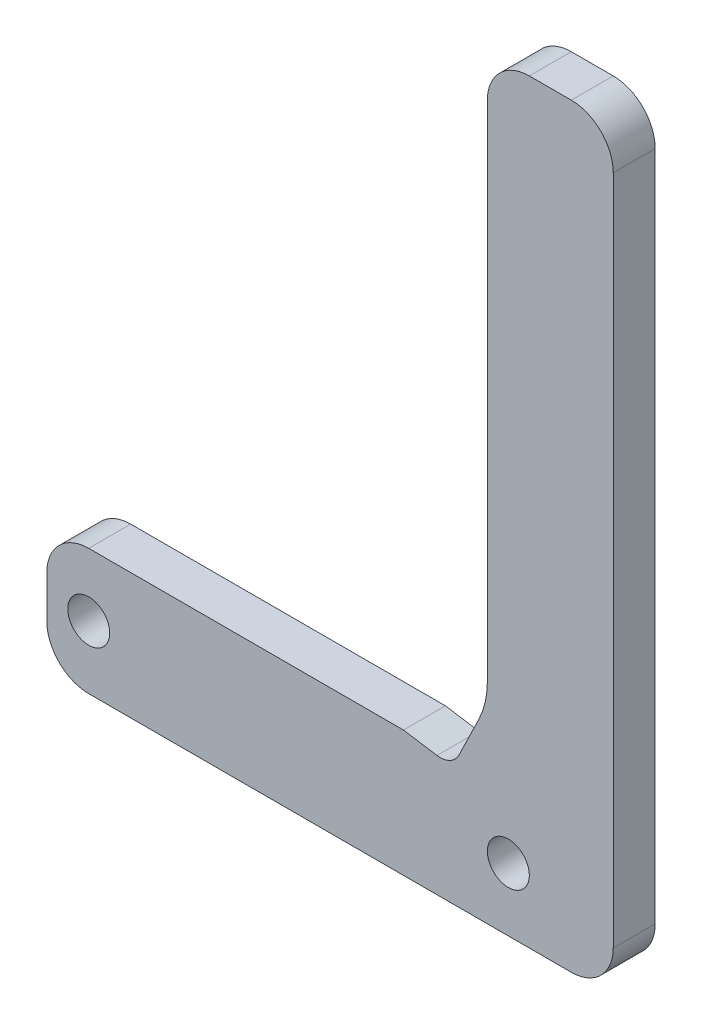
ISO-10303-21;
HEADER;
FILE_DESCRIPTION(('STEP AP214'),'2;1');
FILE_NAME('part.step','',(''),(''),'','','');
FILE_SCHEMA(('AUTOMOTIVE_DESIGN { 1 0 10303 214 1 1 1 1 }'));
ENDSEC;
DATA;
#1=APPLICATION_CONTEXT('core data for automotive mechanical design processes');
#2=APPLICATION_PROTOCOL_DEFINITION('international standard','automotive_design',2000,#1);
#3=PRODUCT_CONTEXT('',#1,'mechanical');
#4=PRODUCT('Part','Part','',(#3));
#5=PRODUCT_RELATED_PRODUCT_CATEGORY('part','',(#4));
#6=PRODUCT_DEFINITION_FORMATION('','',#4);
#7=PRODUCT_DEFINITION_CONTEXT('part definition',#1,'design');
#8=PRODUCT_DEFINITION('design','',#6,#7);
#9=PRODUCT_DEFINITION_SHAPE('','',#8);
#10=(LENGTH_UNIT() NAMED_UNIT(*) SI_UNIT(.MILLI.,.METRE.));
#11=(NAMED_UNIT(*) PLANE_ANGLE_UNIT() SI_UNIT($,.RADIAN.));
#12=(NAMED_UNIT(*) SI_UNIT($,.STERADIAN.) SOLID_ANGLE_UNIT());
#13=UNCERTAINTY_MEASURE_WITH_UNIT(LENGTH_MEASURE(1.E-05),#10,'distance_accuracy_value','');
#14=(GEOMETRIC_REPRESENTATION_CONTEXT(3) GLOBAL_UNCERTAINTY_ASSIGNED_CONTEXT((#13)) GLOBAL_UNIT_ASSIGNED_CONTEXT((#10,
#11,#12)) REPRESENTATION_CONTEXT('',''));
#15=CARTESIAN_POINT('',(0.,0.,0.));
#16=DIRECTION('',(0.,0.,1.));
#17=DIRECTION('',(1.,0.,0.));
#18=AXIS2_PLACEMENT_3D('',#15,#16,#17);
#19=CARTESIAN_POINT('',(0.,0.,6.35));
#20=DIRECTION('',(0.,0.,1.));
#21=DIRECTION('',(1.,0.,0.));
#22=AXIS2_PLACEMENT_3D('',#19,#20,#21);
#23=PLANE('',#22);
#24=CARTESIAN_POINT('',(69.85,9.525,6.35));
#25=DIRECTION('',(0.,0.,1.));
#26=DIRECTION('',(1.,0.,0.));
#27=AXIS2_PLACEMENT_3D('',#24,#25,#26);
#28=CIRCLE('',#27,3.175);
#29=CARTESIAN_POINT('',(73.025,9.525,6.35));
#30=VERTEX_POINT('',#29);
#31=EDGE_CURVE('E179',#30,#30,#28,.T.);
#32=ORIENTED_EDGE('',*,*,#31,.F.);
#33=EDGE_LOOP('',(#32));
#34=FACE_BOUND('',#33,.T.);
#35=CARTESIAN_POINT('',(6.35,9.525,6.35));
#36=DIRECTION('',(0.,0.,1.));
#37=DIRECTION('',(1.,0.,0.));
#38=AXIS2_PLACEMENT_3D('',#35,#36,#37);
#39=CIRCLE('',#38,3.175);
#40=CARTESIAN_POINT('',(9.525,9.525,6.35));
#41=VERTEX_POINT('',#40);
#42=EDGE_CURVE('E173',#41,#41,#39,.T.);
#43=ORIENTED_EDGE('',*,*,#42,.F.);
#44=EDGE_LOOP('',(#43));
#45=FACE_BOUND('',#44,.T.);
#46=CARTESIAN_POINT('',(59.5451465948687,21.3931882071597,6.35));
#47=DIRECTION('',(0.,0.,1.));
#48=DIRECTION('',(1.,0.,0.));
#49=AXIS2_PLACEMENT_3D('',#46,#47,#48);
#50=CIRCLE('',#49,3.17500000000001);
#51=CARTESIAN_POINT('',(59.055,18.25625,6.35));
#52=VERTEX_POINT('',#51);
#53=CARTESIAN_POINT('',(62.4031605487387,20.0102994771873,6.35));
#54=VERTEX_POINT('',#53);
#55=EDGE_CURVE('E163',#52,#54,#50,.T.);
#56=ORIENTED_EDGE('',*,*,#55,.F.);
#57=DIRECTION('',(-0.988012033751101,0.154376880273609,0.));
#58=VECTOR('',#57,1.);
#59=CARTESIAN_POINT('',(4.19196854146806,26.8285986653956,6.35));
#60=LINE('',#59,#58);
#61=CARTESIAN_POINT('',(53.975,19.05,6.35));
#62=VERTEX_POINT('',#61);
#63=EDGE_CURVE('E146',#52,#62,#60,.T.);
#64=ORIENTED_EDGE('',*,*,#63,.T.);
#65=DIRECTION('',(-1.,0.,0.));
#66=VECTOR('',#65,1.);
#67=CARTESIAN_POINT('',(66.675,19.05,6.35));
#68=LINE('',#67,#66);
#69=CARTESIAN_POINT('',(6.35,19.05,6.35));
#70=VERTEX_POINT('',#69);
#71=EDGE_CURVE('E184',#62,#70,#68,.T.);
#72=ORIENTED_EDGE('',*,*,#71,.T.);
#73=CARTESIAN_POINT('',(6.35,12.7,6.35));
#74=DIRECTION('',(0.,0.,1.));
#75=DIRECTION('',(1.,0.,0.));
#76=AXIS2_PLACEMENT_3D('',#73,#74,#75);
#77=CIRCLE('',#76,6.35);
#78=CARTESIAN_POINT('',(0.,12.7,6.35));
#79=VERTEX_POINT('',#78);
#80=EDGE_CURVE('E234',#70,#79,#77,.T.);
#81=ORIENTED_EDGE('',*,*,#80,.T.);
#82=DIRECTION('',(0.,-1.,0.));
#83=VECTOR('',#82,1.);
#84=CARTESIAN_POINT('',(0.,19.05,6.35));
#85=LINE('',#84,#83);
#86=CARTESIAN_POINT('',(0.,6.35,6.35));
#87=VERTEX_POINT('',#86);
#88=EDGE_CURVE('E186',#79,#87,#85,.T.);
#89=ORIENTED_EDGE('',*,*,#88,.T.);
#90=CARTESIAN_POINT('',(6.35,6.35,6.35));
#91=DIRECTION('',(0.,0.,1.));
#92=DIRECTION('',(1.,0.,0.));
#93=AXIS2_PLACEMENT_3D('',#90,#91,#92);
#94=CIRCLE('',#93,6.35);
#95=CARTESIAN_POINT('',(6.35,0.,6.35));
#96=VERTEX_POINT('',#95);
#97=EDGE_CURVE('E236',#87,#96,#94,.T.);
#98=ORIENTED_EDGE('',*,*,#97,.T.);
#99=DIRECTION('',(1.,0.,0.));
#100=VECTOR('',#99,1.);
#101=CARTESIAN_POINT('',(0.,0.,6.35));
#102=LINE('',#101,#100);
#103=CARTESIAN_POINT('',(79.375,0.,6.35));
#104=VERTEX_POINT('',#103);
#105=EDGE_CURVE('E190',#96,#104,#102,.T.);
#106=ORIENTED_EDGE('',*,*,#105,.T.);
#107=CARTESIAN_POINT('',(79.375,6.35,6.35));
#108=DIRECTION('',(0.,0.,1.));
#109=DIRECTION('',(1.,0.,0.));
#110=AXIS2_PLACEMENT_3D('',#107,#108,#109);
#111=CIRCLE('',#110,6.35);
#112=CARTESIAN_POINT('',(85.725,6.35,6.35));
#113=VERTEX_POINT('',#112);
#114=EDGE_CURVE('E238',#104,#113,#111,.T.);
#115=ORIENTED_EDGE('',*,*,#114,.T.);
#116=DIRECTION('',(0.,1.,0.));
#117=VECTOR('',#116,1.);
#118=CARTESIAN_POINT('',(85.725,0.,6.35));
#119=LINE('',#118,#117);
#120=CARTESIAN_POINT('',(85.725,107.95,6.35));
#121=VERTEX_POINT('',#120);
#122=EDGE_CURVE('E193',#113,#121,#119,.T.);
#123=ORIENTED_EDGE('',*,*,#122,.T.);
#124=CARTESIAN_POINT('',(79.375,107.95,6.35));
#125=DIRECTION('',(0.,0.,1.));
#126=DIRECTION('',(1.,0.,0.));
#127=AXIS2_PLACEMENT_3D('',#124,#125,#126);
#128=CIRCLE('',#127,6.35);
#129=CARTESIAN_POINT('',(79.375,114.3,6.35));
#130=VERTEX_POINT('',#129);
#131=EDGE_CURVE('E240',#121,#130,#128,.T.);
#132=ORIENTED_EDGE('',*,*,#131,.T.);
#133=DIRECTION('',(-1.,0.,0.));
#134=VECTOR('',#133,1.);
#135=CARTESIAN_POINT('',(85.725,114.3,6.35));
#136=LINE('',#135,#134);
#137=CARTESIAN_POINT('',(73.025,114.3,6.35));
#138=VERTEX_POINT('',#137);
#139=EDGE_CURVE('E196',#130,#138,#136,.T.);
#140=ORIENTED_EDGE('',*,*,#139,.T.);
#141=CARTESIAN_POINT('',(73.025,107.95,6.35));
#142=DIRECTION('',(0.,0.,1.));
#143=DIRECTION('',(1.,0.,0.));
#144=AXIS2_PLACEMENT_3D('',#141,#142,#143);
#145=CIRCLE('',#144,6.35);
#146=CARTESIAN_POINT('',(66.675,107.95,6.35));
#147=VERTEX_POINT('',#146);
#148=EDGE_CURVE('E242',#138,#147,#145,.T.);
#149=ORIENTED_EDGE('',*,*,#148,.T.);
#150=DIRECTION('',(0.,-1.,0.));
#151=VECTOR('',#150,1.);
#152=CARTESIAN_POINT('',(66.675,114.3,6.35));
#153=LINE('',#152,#151);
#154=CARTESIAN_POINT('',(66.675,31.75,6.35));
#155=VERTEX_POINT('',#154);
#156=EDGE_CURVE('E199',#147,#155,#153,.T.);
#157=ORIENTED_EDGE('',*,*,#156,.T.);
#158=CARTESIAN_POINT('',(53.975,31.75,6.35));
#159=DIRECTION('',(0.,0.,1.));
#160=DIRECTION('',(1.,0.,0.));
#161=AXIS2_PLACEMENT_3D('',#158,#159,#160);
#162=CIRCLE('',#161,12.7);
#163=CARTESIAN_POINT('',(65.4070558154798,26.2184450801104,6.35));
#164=VERTEX_POINT('',#163);
#165=EDGE_CURVE('E11',#155,#164,#162,.F.);
#166=ORIENTED_EDGE('',*,*,#165,.T.);
#167=DIRECTION('',(-0.435555505503119,-0.900161875234628,0.));
#168=VECTOR('',#167,1.);
#169=CARTESIAN_POINT('',(42.719297094111,-20.6703100325301,6.35));
#170=LINE('',#169,#168);
#171=EDGE_CURVE('E47',#164,#54,#170,.T.);
#172=ORIENTED_EDGE('',*,*,#171,.T.);
#173=EDGE_LOOP('',(#56,#64,#72,#81,#89,#98,#106,#115,#123,#132,#140,#149,#157,#166,#172));
#174=FACE_BOUND('',#173,.T.);
#175=ADVANCED_FACE('F32',(#34,#45,#174),#23,.T.);
#176=CARTESIAN_POINT('',(0.,0.,0.));
#177=DIRECTION('',(0.,0.,1.));
#178=DIRECTION('',(1.,0.,0.));
#179=AXIS2_PLACEMENT_3D('',#176,#177,#178);
#180=PLANE('',#179);
#181=CARTESIAN_POINT('',(6.35,9.525,0.));
#182=DIRECTION('',(0.,0.,1.));
#183=DIRECTION('',(1.,0.,0.));
#184=AXIS2_PLACEMENT_3D('',#181,#182,#183);
#185=CIRCLE('',#184,3.175);
#186=CARTESIAN_POINT('',(9.525,9.525,0.));
#187=VERTEX_POINT('',#186);
#188=EDGE_CURVE('E171',#187,#187,#185,.T.);
#189=ORIENTED_EDGE('',*,*,#188,.T.);
#190=EDGE_LOOP('',(#189));
#191=FACE_BOUND('',#190,.T.);
#192=CARTESIAN_POINT('',(69.85,9.525,0.));
#193=DIRECTION('',(0.,0.,1.));
#194=DIRECTION('',(1.,0.,0.));
#195=AXIS2_PLACEMENT_3D('',#192,#193,#194);
#196=CIRCLE('',#195,3.175);
#197=CARTESIAN_POINT('',(73.025,9.525,0.));
#198=VERTEX_POINT('',#197);
#199=EDGE_CURVE('E176',#198,#198,#196,.T.);
#200=ORIENTED_EDGE('',*,*,#199,.T.);
#201=EDGE_LOOP('',(#200));
#202=FACE_BOUND('',#201,.T.);
#203=DIRECTION('',(-0.988012033751101,0.154376880273609,0.));
#204=VECTOR('',#203,1.);
#205=CARTESIAN_POINT('',(4.19196854146806,26.8285986653956,0.));
#206=LINE('',#205,#204);
#207=CARTESIAN_POINT('',(59.055,18.25625,0.));
#208=VERTEX_POINT('',#207);
#209=CARTESIAN_POINT('',(53.975,19.05,0.));
#210=VERTEX_POINT('',#209);
#211=EDGE_CURVE('E143',#208,#210,#206,.T.);
#212=ORIENTED_EDGE('',*,*,#211,.F.);
#213=CARTESIAN_POINT('',(59.5451465948687,21.3931882071597,0.));
#214=DIRECTION('',(0.,0.,1.));
#215=DIRECTION('',(1.,0.,0.));
#216=AXIS2_PLACEMENT_3D('',#213,#214,#215);
#217=CIRCLE('',#216,3.17500000000001);
#218=CARTESIAN_POINT('',(62.4031605487387,20.0102994771873,0.));
#219=VERTEX_POINT('',#218);
#220=EDGE_CURVE('E155',#208,#219,#217,.T.);
#221=ORIENTED_EDGE('',*,*,#220,.T.);
#222=DIRECTION('',(-0.435555505503119,-0.900161875234628,0.));
#223=VECTOR('',#222,1.);
#224=CARTESIAN_POINT('',(42.719297094111,-20.6703100325301,0.));
#225=LINE('',#224,#223);
#226=CARTESIAN_POINT('',(65.4070558154798,26.2184450801104,0.));
#227=VERTEX_POINT('',#226);
#228=EDGE_CURVE('E151',#227,#219,#225,.T.);
#229=ORIENTED_EDGE('',*,*,#228,.F.);
#230=CARTESIAN_POINT('',(53.975,31.75,0.));
#231=DIRECTION('',(0.,0.,1.));
#232=DIRECTION('',(1.,0.,0.));
#233=AXIS2_PLACEMENT_3D('',#230,#231,#232);
#234=CIRCLE('',#233,12.7);
#235=CARTESIAN_POINT('',(66.675,31.75,0.));
#236=VERTEX_POINT('',#235);
#237=EDGE_CURVE('E40',#227,#236,#234,.T.);
#238=ORIENTED_EDGE('',*,*,#237,.T.);
#239=DIRECTION('',(0.,-1.,0.));
#240=VECTOR('',#239,1.);
#241=CARTESIAN_POINT('',(66.675,114.3,0.));
#242=LINE('',#241,#240);
#243=CARTESIAN_POINT('',(66.675,107.95,0.));
#244=VERTEX_POINT('',#243);
#245=EDGE_CURVE('E187',#244,#236,#242,.T.);
#246=ORIENTED_EDGE('',*,*,#245,.F.);
#247=CARTESIAN_POINT('',(73.025,107.95,0.));
#248=DIRECTION('',(0.,0.,1.));
#249=DIRECTION('',(1.,0.,0.));
#250=AXIS2_PLACEMENT_3D('',#247,#248,#249);
#251=CIRCLE('',#250,6.35);
#252=CARTESIAN_POINT('',(73.025,114.3,0.));
#253=VERTEX_POINT('',#252);
#254=EDGE_CURVE('E227',#244,#253,#251,.F.);
#255=ORIENTED_EDGE('',*,*,#254,.T.);
#256=DIRECTION('',(-1.,0.,0.));
#257=VECTOR('',#256,1.);
#258=CARTESIAN_POINT('',(85.725,114.3,0.));
#259=LINE('',#258,#257);
#260=CARTESIAN_POINT('',(79.375,114.3,0.));
#261=VERTEX_POINT('',#260);
#262=EDGE_CURVE('E213',#261,#253,#259,.T.);
#263=ORIENTED_EDGE('',*,*,#262,.F.);
#264=CARTESIAN_POINT('',(79.375,107.95,0.));
#265=DIRECTION('',(0.,0.,1.));
#266=DIRECTION('',(1.,0.,0.));
#267=AXIS2_PLACEMENT_3D('',#264,#265,#266);
#268=CIRCLE('',#267,6.35);
#269=CARTESIAN_POINT('',(85.725,107.95,0.));
#270=VERTEX_POINT('',#269);
#271=EDGE_CURVE('E225',#261,#270,#268,.F.);
#272=ORIENTED_EDGE('',*,*,#271,.T.);
#273=DIRECTION('',(0.,1.,0.));
#274=VECTOR('',#273,1.);
#275=CARTESIAN_POINT('',(85.725,0.,0.));
#276=LINE('',#275,#274);
#277=CARTESIAN_POINT('',(85.725,6.35,0.));
#278=VERTEX_POINT('',#277);
#279=EDGE_CURVE('E210',#278,#270,#276,.T.);
#280=ORIENTED_EDGE('',*,*,#279,.F.);
#281=CARTESIAN_POINT('',(79.375,6.35,0.));
#282=DIRECTION('',(0.,0.,1.));
#283=DIRECTION('',(1.,0.,0.));
#284=AXIS2_PLACEMENT_3D('',#281,#282,#283);
#285=CIRCLE('',#284,6.35);
#286=CARTESIAN_POINT('',(79.375,0.,0.));
#287=VERTEX_POINT('',#286);
#288=EDGE_CURVE('E223',#278,#287,#285,.F.);
#289=ORIENTED_EDGE('',*,*,#288,.T.);
#290=DIRECTION('',(1.,0.,0.));
#291=VECTOR('',#290,1.);
#292=CARTESIAN_POINT('',(0.,0.,0.));
#293=LINE('',#292,#291);
#294=CARTESIAN_POINT('',(6.35,0.,0.));
#295=VERTEX_POINT('',#294);
#296=EDGE_CURVE('E207',#295,#287,#293,.T.);
#297=ORIENTED_EDGE('',*,*,#296,.F.);
#298=CARTESIAN_POINT('',(6.35,6.35,0.));
#299=DIRECTION('',(0.,0.,1.));
#300=DIRECTION('',(1.,0.,0.));
#301=AXIS2_PLACEMENT_3D('',#298,#299,#300);
#302=CIRCLE('',#301,6.35);
#303=CARTESIAN_POINT('',(0.,6.35,0.));
#304=VERTEX_POINT('',#303);
#305=EDGE_CURVE('E221',#295,#304,#302,.F.);
#306=ORIENTED_EDGE('',*,*,#305,.T.);
#307=DIRECTION('',(0.,-1.,0.));
#308=VECTOR('',#307,1.);
#309=CARTESIAN_POINT('',(0.,19.05,0.));
#310=LINE('',#309,#308);
#311=CARTESIAN_POINT('',(0.,12.7,0.));
#312=VERTEX_POINT('',#311);
#313=EDGE_CURVE('E204',#312,#304,#310,.T.);
#314=ORIENTED_EDGE('',*,*,#313,.F.);
#315=CARTESIAN_POINT('',(6.35,12.7,0.));
#316=DIRECTION('',(0.,0.,1.));
#317=DIRECTION('',(1.,0.,0.));
#318=AXIS2_PLACEMENT_3D('',#315,#316,#317);
#319=CIRCLE('',#318,6.35);
#320=CARTESIAN_POINT('',(6.35,19.05,0.));
#321=VERTEX_POINT('',#320);
#322=EDGE_CURVE('E219',#312,#321,#319,.F.);
#323=ORIENTED_EDGE('',*,*,#322,.T.);
#324=DIRECTION('',(-1.,0.,0.));
#325=VECTOR('',#324,1.);
#326=CARTESIAN_POINT('',(66.675,19.05,0.));
#327=LINE('',#326,#325);
#328=EDGE_CURVE('E161',#210,#321,#327,.T.);
#329=ORIENTED_EDGE('',*,*,#328,.F.);
#330=EDGE_LOOP('',(#212,#221,#229,#238,#246,#255,#263,#272,#280,#289,#297,#306,#314,#323,#329));
#331=FACE_BOUND('',#330,.T.);
#332=ADVANCED_FACE('F159',(#191,#202,#331),#180,.F.);
#333=CARTESIAN_POINT('',(53.975,31.75,6.35));
#334=DIRECTION('',(0.,0.,1.));
#335=DIRECTION('',(1.,0.,0.));
#336=AXIS2_PLACEMENT_3D('',#333,#334,#335);
#337=CYLINDRICAL_SURFACE('',#336,12.7);
#338=DIRECTION('',(0.,0.,1.));
#339=VECTOR('',#338,1.);
#340=CARTESIAN_POINT('',(65.4070558154798,26.2184450801104,0.));
#341=LINE('',#340,#339);
#342=EDGE_CURVE('E169',#227,#164,#341,.T.);
#343=ORIENTED_EDGE('',*,*,#342,.T.);
#344=ORIENTED_EDGE('',*,*,#165,.F.);
#345=DIRECTION('',(0.,0.,-1.));
#346=VECTOR('',#345,1.);
#347=CARTESIAN_POINT('',(66.675,31.75,6.35));
#348=LINE('',#347,#346);
#349=EDGE_CURVE('E264',#236,#155,#348,.F.);
#350=ORIENTED_EDGE('',*,*,#349,.F.);
#351=ORIENTED_EDGE('',*,*,#237,.F.);
#352=EDGE_LOOP('',(#343,#344,#350,#351));
#353=FACE_BOUND('',#352,.T.);
#354=ADVANCED_FACE('F34',(#353),#337,.F.);
#355=CARTESIAN_POINT('',(66.675,19.05,6.35));
#356=DIRECTION('',(0.,-1.,0.));
#357=DIRECTION('',(1.,0.,0.));
#358=AXIS2_PLACEMENT_3D('',#355,#356,#357);
#359=PLANE('',#358);
#360=ORIENTED_EDGE('',*,*,#71,.F.);
#361=DIRECTION('',(0.,0.,-1.));
#362=VECTOR('',#361,1.);
#363=CARTESIAN_POINT('',(53.975,19.05,0.));
#364=LINE('',#363,#362);
#365=EDGE_CURVE('E262',#62,#210,#364,.T.);
#366=ORIENTED_EDGE('',*,*,#365,.T.);
#367=ORIENTED_EDGE('',*,*,#328,.T.);
#368=DIRECTION('',(0.,0.,-1.));
#369=VECTOR('',#368,1.);
#370=CARTESIAN_POINT('',(6.35,19.05,6.35));
#371=LINE('',#370,#369);
#372=EDGE_CURVE('E259',#321,#70,#371,.F.);
#373=ORIENTED_EDGE('',*,*,#372,.T.);
#374=EDGE_LOOP('',(#360,#366,#367,#373));
#375=FACE_BOUND('',#374,.T.);
#376=ADVANCED_FACE('F277',(#375),#359,.F.);
#377=CARTESIAN_POINT('',(0.,19.05,6.35));
#378=DIRECTION('',(1.,0.,0.));
#379=DIRECTION('',(0.,0.,-1.));
#380=AXIS2_PLACEMENT_3D('',#377,#378,#379);
#381=PLANE('',#380);
#382=ORIENTED_EDGE('',*,*,#313,.T.);
#383=DIRECTION('',(0.,0.,-1.));
#384=VECTOR('',#383,1.);
#385=CARTESIAN_POINT('',(0.,6.35,6.35));
#386=LINE('',#385,#384);
#387=EDGE_CURVE('E257',#304,#87,#386,.F.);
#388=ORIENTED_EDGE('',*,*,#387,.T.);
#389=ORIENTED_EDGE('',*,*,#88,.F.);
#390=DIRECTION('',(0.,0.,-1.));
#391=VECTOR('',#390,1.);
#392=CARTESIAN_POINT('',(0.,12.7,6.35));
#393=LINE('',#392,#391);
#394=EDGE_CURVE('E254',#79,#312,#393,.T.);
#395=ORIENTED_EDGE('',*,*,#394,.T.);
#396=EDGE_LOOP('',(#382,#388,#389,#395));
#397=FACE_BOUND('',#396,.T.);
#398=ADVANCED_FACE('F286',(#397),#381,.F.);
#399=CARTESIAN_POINT('',(0.,0.,6.35));
#400=DIRECTION('',(0.,1.,0.));
#401=DIRECTION('',(0.,0.,1.));
#402=AXIS2_PLACEMENT_3D('',#399,#400,#401);
#403=PLANE('',#402);
#404=ORIENTED_EDGE('',*,*,#296,.T.);
#405=DIRECTION('',(0.,0.,-1.));
#406=VECTOR('',#405,1.);
#407=CARTESIAN_POINT('',(79.375,0.,6.35));
#408=LINE('',#407,#406);
#409=EDGE_CURVE('E252',#287,#104,#408,.F.);
#410=ORIENTED_EDGE('',*,*,#409,.T.);
#411=ORIENTED_EDGE('',*,*,#105,.F.);
#412=DIRECTION('',(0.,0.,-1.));
#413=VECTOR('',#412,1.);
#414=CARTESIAN_POINT('',(6.35,0.,6.35));
#415=LINE('',#414,#413);
#416=EDGE_CURVE('E249',#96,#295,#415,.T.);
#417=ORIENTED_EDGE('',*,*,#416,.T.);
#418=EDGE_LOOP('',(#404,#410,#411,#417));
#419=FACE_BOUND('',#418,.T.);
#420=ADVANCED_FACE('F295',(#419),#403,.F.);
#421=CARTESIAN_POINT('',(85.725,0.,6.35));
#422=DIRECTION('',(-1.,0.,0.));
#423=DIRECTION('',(0.,0.,1.));
#424=AXIS2_PLACEMENT_3D('',#421,#422,#423);
#425=PLANE('',#424);
#426=ORIENTED_EDGE('',*,*,#279,.T.);
#427=DIRECTION('',(0.,0.,-1.));
#428=VECTOR('',#427,1.);
#429=CARTESIAN_POINT('',(85.725,107.95,6.35));
#430=LINE('',#429,#428);
#431=EDGE_CURVE('E247',#270,#121,#430,.F.);
#432=ORIENTED_EDGE('',*,*,#431,.T.);
#433=ORIENTED_EDGE('',*,*,#122,.F.);
#434=DIRECTION('',(0.,0.,-1.));
#435=VECTOR('',#434,1.);
#436=CARTESIAN_POINT('',(85.725,6.35,6.35));
#437=LINE('',#436,#435);
#438=EDGE_CURVE('E244',#113,#278,#437,.T.);
#439=ORIENTED_EDGE('',*,*,#438,.T.);
#440=EDGE_LOOP('',(#426,#432,#433,#439));
#441=FACE_BOUND('',#440,.T.);
#442=ADVANCED_FACE('F304',(#441),#425,.F.);
#443=CARTESIAN_POINT('',(85.725,114.3,6.35));
#444=DIRECTION('',(0.,-1.,0.));
#445=DIRECTION('',(0.,0.,-1.));
#446=AXIS2_PLACEMENT_3D('',#443,#444,#445);
#447=PLANE('',#446);
#448=ORIENTED_EDGE('',*,*,#262,.T.);
#449=DIRECTION('',(0.,0.,-1.));
#450=VECTOR('',#449,1.);
#451=CARTESIAN_POINT('',(73.025,114.3,6.35));
#452=LINE('',#451,#450);
#453=EDGE_CURVE('E232',#253,#138,#452,.F.);
#454=ORIENTED_EDGE('',*,*,#453,.T.);
#455=ORIENTED_EDGE('',*,*,#139,.F.);
#456=DIRECTION('',(0.,0.,-1.));
#457=VECTOR('',#456,1.);
#458=CARTESIAN_POINT('',(79.375,114.3,6.35));
#459=LINE('',#458,#457);
#460=EDGE_CURVE('E229',#130,#261,#459,.T.);
#461=ORIENTED_EDGE('',*,*,#460,.T.);
#462=EDGE_LOOP('',(#448,#454,#455,#461));
#463=FACE_BOUND('',#462,.T.);
#464=ADVANCED_FACE('F312',(#463),#447,.F.);
#465=CARTESIAN_POINT('',(66.675,114.3,6.35));
#466=DIRECTION('',(1.,0.,0.));
#467=DIRECTION('',(0.,1.,0.));
#468=AXIS2_PLACEMENT_3D('',#465,#466,#467);
#469=PLANE('',#468);
#470=ORIENTED_EDGE('',*,*,#245,.T.);
#471=ORIENTED_EDGE('',*,*,#349,.T.);
#472=ORIENTED_EDGE('',*,*,#156,.F.);
#473=DIRECTION('',(0.,0.,-1.));
#474=VECTOR('',#473,1.);
#475=CARTESIAN_POINT('',(66.675,107.95,6.35));
#476=LINE('',#475,#474);
#477=EDGE_CURVE('E202',#147,#244,#476,.T.);
#478=ORIENTED_EDGE('',*,*,#477,.T.);
#479=EDGE_LOOP('',(#470,#471,#472,#478));
#480=FACE_BOUND('',#479,.T.);
#481=ADVANCED_FACE('F268',(#480),#469,.F.);
#482=CARTESIAN_POINT('',(69.85,9.525,6.35));
#483=DIRECTION('',(0.,0.,-1.));
#484=DIRECTION('',(-1.,0.,0.));
#485=AXIS2_PLACEMENT_3D('',#482,#483,#484);
#486=CYLINDRICAL_SURFACE('',#485,3.175);
#487=ORIENTED_EDGE('',*,*,#31,.T.);
#488=EDGE_LOOP('',(#487));
#489=FACE_BOUND('',#488,.T.);
#490=ORIENTED_EDGE('',*,*,#199,.F.);
#491=EDGE_LOOP('',(#490));
#492=FACE_BOUND('',#491,.T.);
#493=ADVANCED_FACE('F325',(#489,#492),#486,.F.);
#494=CARTESIAN_POINT('',(6.35,9.525,6.35));
#495=DIRECTION('',(0.,0.,-1.));
#496=DIRECTION('',(-1.,0.,0.));
#497=AXIS2_PLACEMENT_3D('',#494,#495,#496);
#498=CYLINDRICAL_SURFACE('',#497,3.175);
#499=ORIENTED_EDGE('',*,*,#42,.T.);
#500=EDGE_LOOP('',(#499));
#501=FACE_BOUND('',#500,.T.);
#502=ORIENTED_EDGE('',*,*,#188,.F.);
#503=EDGE_LOOP('',(#502));
#504=FACE_BOUND('',#503,.T.);
#505=ADVANCED_FACE('F318',(#501,#504),#498,.F.);
#506=CARTESIAN_POINT('',(73.025,107.95,6.35));
#507=DIRECTION('',(0.,0.,-1.));
#508=DIRECTION('',(-1.,0.,0.));
#509=AXIS2_PLACEMENT_3D('',#506,#507,#508);
#510=CYLINDRICAL_SURFACE('',#509,6.35);
#511=ORIENTED_EDGE('',*,*,#148,.F.);
#512=ORIENTED_EDGE('',*,*,#453,.F.);
#513=ORIENTED_EDGE('',*,*,#254,.F.);
#514=ORIENTED_EDGE('',*,*,#477,.F.);
#515=EDGE_LOOP('',(#511,#512,#513,#514));
#516=FACE_BOUND('',#515,.T.);
#517=ADVANCED_FACE('F316',(#516),#510,.T.);
#518=CARTESIAN_POINT('',(79.375,107.95,6.35));
#519=DIRECTION('',(0.,0.,-1.));
#520=DIRECTION('',(-1.,0.,0.));
#521=AXIS2_PLACEMENT_3D('',#518,#519,#520);
#522=CYLINDRICAL_SURFACE('',#521,6.35);
#523=ORIENTED_EDGE('',*,*,#131,.F.);
#524=ORIENTED_EDGE('',*,*,#431,.F.);
#525=ORIENTED_EDGE('',*,*,#271,.F.);
#526=ORIENTED_EDGE('',*,*,#460,.F.);
#527=EDGE_LOOP('',(#523,#524,#525,#526));
#528=FACE_BOUND('',#527,.T.);
#529=ADVANCED_FACE('F308',(#528),#522,.T.);
#530=CARTESIAN_POINT('',(79.375,6.35,6.35));
#531=DIRECTION('',(0.,0.,-1.));
#532=DIRECTION('',(-1.,0.,0.));
#533=AXIS2_PLACEMENT_3D('',#530,#531,#532);
#534=CYLINDRICAL_SURFACE('',#533,6.35);
#535=ORIENTED_EDGE('',*,*,#114,.F.);
#536=ORIENTED_EDGE('',*,*,#409,.F.);
#537=ORIENTED_EDGE('',*,*,#288,.F.);
#538=ORIENTED_EDGE('',*,*,#438,.F.);
#539=EDGE_LOOP('',(#535,#536,#537,#538));
#540=FACE_BOUND('',#539,.T.);
#541=ADVANCED_FACE('F299',(#540),#534,.T.);
#542=CARTESIAN_POINT('',(6.35,6.35,6.35));
#543=DIRECTION('',(0.,0.,-1.));
#544=DIRECTION('',(-1.,0.,0.));
#545=AXIS2_PLACEMENT_3D('',#542,#543,#544);
#546=CYLINDRICAL_SURFACE('',#545,6.35);
#547=ORIENTED_EDGE('',*,*,#97,.F.);
#548=ORIENTED_EDGE('',*,*,#387,.F.);
#549=ORIENTED_EDGE('',*,*,#305,.F.);
#550=ORIENTED_EDGE('',*,*,#416,.F.);
#551=EDGE_LOOP('',(#547,#548,#549,#550));
#552=FACE_BOUND('',#551,.T.);
#553=ADVANCED_FACE('F290',(#552),#546,.T.);
#554=CARTESIAN_POINT('',(6.35,12.7,6.35));
#555=DIRECTION('',(0.,0.,-1.));
#556=DIRECTION('',(-1.,0.,0.));
#557=AXIS2_PLACEMENT_3D('',#554,#555,#556);
#558=CYLINDRICAL_SURFACE('',#557,6.35);
#559=ORIENTED_EDGE('',*,*,#80,.F.);
#560=ORIENTED_EDGE('',*,*,#372,.F.);
#561=ORIENTED_EDGE('',*,*,#322,.F.);
#562=ORIENTED_EDGE('',*,*,#394,.F.);
#563=EDGE_LOOP('',(#559,#560,#561,#562));
#564=FACE_BOUND('',#563,.T.);
#565=ADVANCED_FACE('F282',(#564),#558,.T.);
#566=CARTESIAN_POINT('',(4.19196854146806,26.8285986653956,0.));
#567=DIRECTION('',(0.154376880273609,0.988012033751101,0.));
#568=DIRECTION('',(-0.988012033751101,0.154376880273609,0.));
#569=AXIS2_PLACEMENT_3D('',#566,#567,#568);
#570=PLANE('',#569);
#571=ORIENTED_EDGE('',*,*,#63,.F.);
#572=DIRECTION('',(0.,0.,1.));
#573=VECTOR('',#572,1.);
#574=CARTESIAN_POINT('',(59.055,18.25625,0.));
#575=LINE('',#574,#573);
#576=EDGE_CURVE('E139',#208,#52,#575,.T.);
#577=ORIENTED_EDGE('',*,*,#576,.F.);
#578=ORIENTED_EDGE('',*,*,#211,.T.);
#579=ORIENTED_EDGE('',*,*,#365,.F.);
#580=EDGE_LOOP('',(#571,#577,#578,#579));
#581=FACE_BOUND('',#580,.T.);
#582=ADVANCED_FACE('F141',(#581),#570,.T.);
#583=CARTESIAN_POINT('',(42.719297094111,-20.6703100325301,0.));
#584=DIRECTION('',(-0.900161875234628,0.435555505503119,0.));
#585=DIRECTION('',(-0.435555505503119,-0.900161875234628,0.));
#586=AXIS2_PLACEMENT_3D('',#583,#584,#585);
#587=PLANE('',#586);
#588=ORIENTED_EDGE('',*,*,#171,.F.);
#589=ORIENTED_EDGE('',*,*,#342,.F.);
#590=ORIENTED_EDGE('',*,*,#228,.T.);
#591=DIRECTION('',(0.,0.,1.));
#592=VECTOR('',#591,1.);
#593=CARTESIAN_POINT('',(62.4031605487387,20.0102994771873,0.));
#594=LINE('',#593,#592);
#595=EDGE_CURVE('E150',#219,#54,#594,.T.);
#596=ORIENTED_EDGE('',*,*,#595,.T.);
#597=EDGE_LOOP('',(#588,#589,#590,#596));
#598=FACE_BOUND('',#597,.T.);
#599=ADVANCED_FACE('F274',(#598),#587,.T.);
#600=CARTESIAN_POINT('',(59.5451465948687,21.3931882071597,0.));
#601=DIRECTION('',(0.,0.,1.));
#602=DIRECTION('',(1.,0.,0.));
#603=AXIS2_PLACEMENT_3D('',#600,#601,#602);
#604=CYLINDRICAL_SURFACE('',#603,3.17500000000001);
#605=ORIENTED_EDGE('',*,*,#55,.T.);
#606=ORIENTED_EDGE('',*,*,#595,.F.);
#607=ORIENTED_EDGE('',*,*,#220,.F.);
#608=ORIENTED_EDGE('',*,*,#576,.T.);
#609=EDGE_LOOP('',(#605,#606,#607,#608));
#610=FACE_BOUND('',#609,.T.);
#611=ADVANCED_FACE('F156',(#610),#604,.F.);
#612=CLOSED_SHELL('',(#175,#332,#354,#376,#398,#420,#442,#464,#481,#493,#505,#517,#529,#541,
#553,#565,#582,#599,#611));
#613=MANIFOLD_SOLID_BREP('B2',#612);
#614=ADVANCED_BREP_SHAPE_REPRESENTATION('',(#18,#613),#14);
#615=SHAPE_DEFINITION_REPRESENTATION(#9,#614);
ENDSEC;
END-ISO-10303-21;
